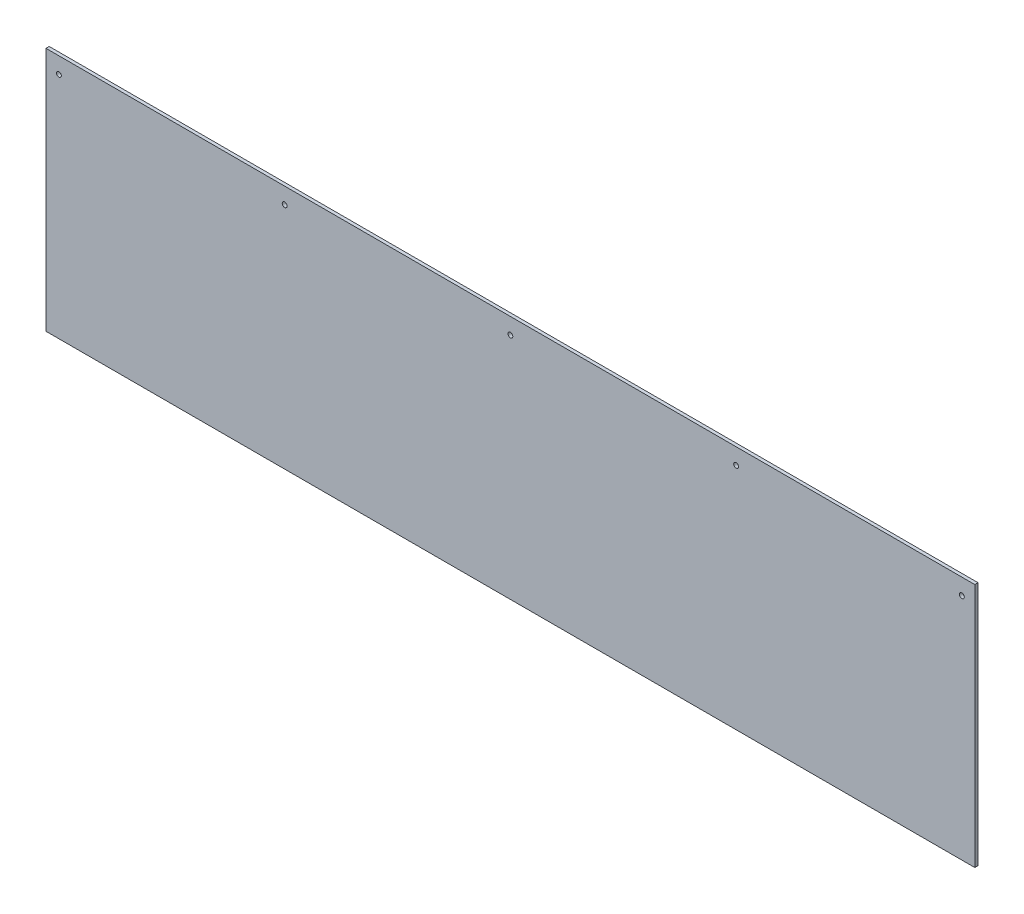
ISO-10303-21;
HEADER;
FILE_DESCRIPTION(('STEP AP214'),'2;1');
FILE_NAME('part.step','',(''),(''),'','','');
FILE_SCHEMA(('AUTOMOTIVE_DESIGN { 1 0 10303 214 1 1 1 1 }'));
ENDSEC;
DATA;
#1=APPLICATION_CONTEXT('core data for automotive mechanical design processes');
#2=APPLICATION_PROTOCOL_DEFINITION('international standard','automotive_design',2000,#1);
#3=PRODUCT_CONTEXT('',#1,'mechanical');
#4=PRODUCT('Part','Part','',(#3));
#5=PRODUCT_RELATED_PRODUCT_CATEGORY('part','',(#4));
#6=PRODUCT_DEFINITION_FORMATION('','',#4);
#7=PRODUCT_DEFINITION_CONTEXT('part definition',#1,'design');
#8=PRODUCT_DEFINITION('design','',#6,#7);
#9=PRODUCT_DEFINITION_SHAPE('','',#8);
#10=(LENGTH_UNIT() NAMED_UNIT(*) SI_UNIT(.MILLI.,.METRE.));
#11=(NAMED_UNIT(*) PLANE_ANGLE_UNIT() SI_UNIT($,.RADIAN.));
#12=(NAMED_UNIT(*) SI_UNIT($,.STERADIAN.) SOLID_ANGLE_UNIT());
#13=UNCERTAINTY_MEASURE_WITH_UNIT(LENGTH_MEASURE(1.E-05),#10,'distance_accuracy_value','');
#14=(GEOMETRIC_REPRESENTATION_CONTEXT(3) GLOBAL_UNCERTAINTY_ASSIGNED_CONTEXT((#13)) GLOBAL_UNIT_ASSIGNED_CONTEXT((#10,
#11,#12)) REPRESENTATION_CONTEXT('',''));
#15=CARTESIAN_POINT('',(0.,0.,0.));
#16=DIRECTION('',(0.,0.,1.));
#17=DIRECTION('',(1.,0.,0.));
#18=AXIS2_PLACEMENT_3D('',#15,#16,#17);
#19=CARTESIAN_POINT('',(0.,0.,6.35));
#20=DIRECTION('',(1.,0.,0.));
#21=DIRECTION('',(0.,0.,-1.));
#22=AXIS2_PLACEMENT_3D('',#19,#20,#21);
#23=PLANE('',#22);
#24=DIRECTION('',(0.,-1.,0.));
#25=VECTOR('',#24,1.);
#26=CARTESIAN_POINT('',(0.,0.,0.));
#27=LINE('',#26,#25);
#28=CARTESIAN_POINT('',(0.,482.6,0.));
#29=VERTEX_POINT('',#28);
#30=CARTESIAN_POINT('',(0.,0.,0.));
#31=VERTEX_POINT('',#30);
#32=EDGE_CURVE('E96',#29,#31,#27,.T.);
#33=ORIENTED_EDGE('',*,*,#32,.T.);
#34=DIRECTION('',(0.,0.,-1.));
#35=VECTOR('',#34,1.);
#36=CARTESIAN_POINT('',(0.,0.,6.35));
#37=LINE('',#36,#35);
#38=CARTESIAN_POINT('',(0.,0.,6.35));
#39=VERTEX_POINT('',#38);
#40=EDGE_CURVE('E11',#39,#31,#37,.T.);
#41=ORIENTED_EDGE('',*,*,#40,.F.);
#42=DIRECTION('',(0.,-1.,0.));
#43=VECTOR('',#42,1.);
#44=CARTESIAN_POINT('',(0.,0.,6.35));
#45=LINE('',#44,#43);
#46=CARTESIAN_POINT('',(0.,482.6,6.35));
#47=VERTEX_POINT('',#46);
#48=EDGE_CURVE('E84',#47,#39,#45,.T.);
#49=ORIENTED_EDGE('',*,*,#48,.F.);
#50=DIRECTION('',(0.,0.,-1.));
#51=VECTOR('',#50,1.);
#52=CARTESIAN_POINT('',(0.,482.6,6.35));
#53=LINE('',#52,#51);
#54=EDGE_CURVE('E92',#47,#29,#53,.T.);
#55=ORIENTED_EDGE('',*,*,#54,.T.);
#56=EDGE_LOOP('',(#33,#41,#49,#55));
#57=FACE_BOUND('',#56,.T.);
#58=ADVANCED_FACE('F33',(#57),#23,.F.);
#59=CARTESIAN_POINT('',(0.,0.,6.35));
#60=DIRECTION('',(0.,1.,0.));
#61=DIRECTION('',(0.,0.,1.));
#62=AXIS2_PLACEMENT_3D('',#59,#60,#61);
#63=PLANE('',#62);
#64=DIRECTION('',(1.,0.,0.));
#65=VECTOR('',#64,1.);
#66=CARTESIAN_POINT('',(0.,0.,0.));
#67=LINE('',#66,#65);
#68=CARTESIAN_POINT('',(1828.8,0.,0.));
#69=VERTEX_POINT('',#68);
#70=EDGE_CURVE('E88',#31,#69,#67,.T.);
#71=ORIENTED_EDGE('',*,*,#70,.T.);
#72=DIRECTION('',(0.,0.,-1.));
#73=VECTOR('',#72,1.);
#74=CARTESIAN_POINT('',(1828.8,0.,6.35));
#75=LINE('',#74,#73);
#76=CARTESIAN_POINT('',(1828.8,0.,6.35));
#77=VERTEX_POINT('',#76);
#78=EDGE_CURVE('E41',#77,#69,#75,.T.);
#79=ORIENTED_EDGE('',*,*,#78,.F.);
#80=DIRECTION('',(1.,0.,0.));
#81=VECTOR('',#80,1.);
#82=CARTESIAN_POINT('',(0.,0.,6.35));
#83=LINE('',#82,#81);
#84=EDGE_CURVE('E79',#39,#77,#83,.T.);
#85=ORIENTED_EDGE('',*,*,#84,.F.);
#86=ORIENTED_EDGE('',*,*,#40,.T.);
#87=EDGE_LOOP('',(#71,#79,#85,#86));
#88=FACE_BOUND('',#87,.T.);
#89=ADVANCED_FACE('F87',(#88),#63,.F.);
#90=CARTESIAN_POINT('',(1828.8,0.,6.35));
#91=DIRECTION('',(-1.,0.,0.));
#92=DIRECTION('',(0.,0.,1.));
#93=AXIS2_PLACEMENT_3D('',#90,#91,#92);
#94=PLANE('',#93);
#95=DIRECTION('',(0.,1.,0.));
#96=VECTOR('',#95,1.);
#97=CARTESIAN_POINT('',(1828.8,0.,0.));
#98=LINE('',#97,#96);
#99=CARTESIAN_POINT('',(1828.8,482.6,0.));
#100=VERTEX_POINT('',#99);
#101=EDGE_CURVE('E66',#69,#100,#98,.T.);
#102=ORIENTED_EDGE('',*,*,#101,.T.);
#103=DIRECTION('',(0.,0.,-1.));
#104=VECTOR('',#103,1.);
#105=CARTESIAN_POINT('',(1828.8,482.6,6.35));
#106=LINE('',#105,#104);
#107=CARTESIAN_POINT('',(1828.8,482.6,6.35));
#108=VERTEX_POINT('',#107);
#109=EDGE_CURVE('E89',#108,#100,#106,.T.);
#110=ORIENTED_EDGE('',*,*,#109,.F.);
#111=DIRECTION('',(0.,1.,0.));
#112=VECTOR('',#111,1.);
#113=CARTESIAN_POINT('',(1828.8,0.,6.35));
#114=LINE('',#113,#112);
#115=EDGE_CURVE('E82',#77,#108,#114,.T.);
#116=ORIENTED_EDGE('',*,*,#115,.F.);
#117=ORIENTED_EDGE('',*,*,#78,.T.);
#118=EDGE_LOOP('',(#102,#110,#116,#117));
#119=FACE_BOUND('',#118,.T.);
#120=ADVANCED_FACE('F90',(#119),#94,.F.);
#121=CARTESIAN_POINT('',(0.,482.6,6.35));
#122=DIRECTION('',(0.,-1.,0.));
#123=DIRECTION('',(1.,0.,0.));
#124=AXIS2_PLACEMENT_3D('',#121,#122,#123);
#125=PLANE('',#124);
#126=DIRECTION('',(-1.,0.,0.));
#127=VECTOR('',#126,1.);
#128=CARTESIAN_POINT('',(0.,482.6,0.));
#129=LINE('',#128,#127);
#130=EDGE_CURVE('E72',#100,#29,#129,.T.);
#131=ORIENTED_EDGE('',*,*,#130,.T.);
#132=ORIENTED_EDGE('',*,*,#54,.F.);
#133=DIRECTION('',(-1.,0.,0.));
#134=VECTOR('',#133,1.);
#135=CARTESIAN_POINT('',(0.,482.6,6.35));
#136=LINE('',#135,#134);
#137=EDGE_CURVE('E49',#108,#47,#136,.T.);
#138=ORIENTED_EDGE('',*,*,#137,.F.);
#139=ORIENTED_EDGE('',*,*,#109,.T.);
#140=EDGE_LOOP('',(#131,#132,#138,#139));
#141=FACE_BOUND('',#140,.T.);
#142=ADVANCED_FACE('F104',(#141),#125,.F.);
#143=CARTESIAN_POINT('',(0.,0.,6.35));
#144=DIRECTION('',(0.,0.,-1.));
#145=DIRECTION('',(-1.,0.,0.));
#146=AXIS2_PLACEMENT_3D('',#143,#144,#145);
#147=PLANE('',#146);
#148=CARTESIAN_POINT('',(25.4,450.85,6.35));
#149=DIRECTION('',(0.,0.,1.));
#150=DIRECTION('',(1.,0.,0.));
#151=AXIS2_PLACEMENT_3D('',#148,#149,#150);
#152=CIRCLE('',#151,4.7625);
#153=CARTESIAN_POINT('',(30.1625,450.85,6.35));
#154=VERTEX_POINT('',#153);
#155=EDGE_CURVE('E134',#154,#154,#152,.T.);
#156=ORIENTED_EDGE('',*,*,#155,.F.);
#157=EDGE_LOOP('',(#156));
#158=FACE_BOUND('',#157,.T.);
#159=CARTESIAN_POINT('',(469.9,450.85,6.35));
#160=DIRECTION('',(0.,0.,1.));
#161=DIRECTION('',(1.,0.,0.));
#162=AXIS2_PLACEMENT_3D('',#159,#160,#161);
#163=CIRCLE('',#162,4.76250000000001);
#164=CARTESIAN_POINT('',(474.6625,450.85,6.35));
#165=VERTEX_POINT('',#164);
#166=EDGE_CURVE('E128',#165,#165,#163,.T.);
#167=ORIENTED_EDGE('',*,*,#166,.F.);
#168=EDGE_LOOP('',(#167));
#169=FACE_BOUND('',#168,.T.);
#170=CARTESIAN_POINT('',(914.4,450.85,6.35));
#171=DIRECTION('',(0.,0.,1.));
#172=DIRECTION('',(1.,0.,0.));
#173=AXIS2_PLACEMENT_3D('',#170,#171,#172);
#174=CIRCLE('',#173,4.76250000000001);
#175=CARTESIAN_POINT('',(919.1625,450.85,6.35));
#176=VERTEX_POINT('',#175);
#177=EDGE_CURVE('E122',#176,#176,#174,.T.);
#178=ORIENTED_EDGE('',*,*,#177,.F.);
#179=EDGE_LOOP('',(#178));
#180=FACE_BOUND('',#179,.T.);
#181=CARTESIAN_POINT('',(1358.9,450.85,6.35));
#182=DIRECTION('',(0.,0.,1.));
#183=DIRECTION('',(1.,0.,0.));
#184=AXIS2_PLACEMENT_3D('',#181,#182,#183);
#185=CIRCLE('',#184,4.7624999999999);
#186=CARTESIAN_POINT('',(1363.6625,450.85,6.35));
#187=VERTEX_POINT('',#186);
#188=EDGE_CURVE('E116',#187,#187,#185,.T.);
#189=ORIENTED_EDGE('',*,*,#188,.F.);
#190=EDGE_LOOP('',(#189));
#191=FACE_BOUND('',#190,.T.);
#192=CARTESIAN_POINT('',(1803.4,450.85,6.35));
#193=DIRECTION('',(0.,0.,1.));
#194=DIRECTION('',(1.,0.,0.));
#195=AXIS2_PLACEMENT_3D('',#192,#193,#194);
#196=CIRCLE('',#195,4.7624999999999);
#197=CARTESIAN_POINT('',(1808.1625,450.85,6.35));
#198=VERTEX_POINT('',#197);
#199=EDGE_CURVE('E110',#198,#198,#196,.T.);
#200=ORIENTED_EDGE('',*,*,#199,.F.);
#201=EDGE_LOOP('',(#200));
#202=FACE_BOUND('',#201,.T.);
#203=ORIENTED_EDGE('',*,*,#48,.T.);
#204=ORIENTED_EDGE('',*,*,#84,.T.);
#205=ORIENTED_EDGE('',*,*,#115,.T.);
#206=ORIENTED_EDGE('',*,*,#137,.T.);
#207=EDGE_LOOP('',(#203,#204,#205,#206));
#208=FACE_BOUND('',#207,.T.);
#209=ADVANCED_FACE('F80',(#158,#169,#180,#191,#202,#208),#147,.F.);
#210=CARTESIAN_POINT('',(0.,0.,0.));
#211=DIRECTION('',(0.,0.,-1.));
#212=DIRECTION('',(-1.,0.,0.));
#213=AXIS2_PLACEMENT_3D('',#210,#211,#212);
#214=PLANE('',#213);
#215=CARTESIAN_POINT('',(25.4,450.85,0.));
#216=DIRECTION('',(0.,0.,1.));
#217=DIRECTION('',(1.,0.,0.));
#218=AXIS2_PLACEMENT_3D('',#215,#216,#217);
#219=CIRCLE('',#218,4.7625);
#220=CARTESIAN_POINT('',(30.1625,450.85,0.));
#221=VERTEX_POINT('',#220);
#222=EDGE_CURVE('E99',#221,#221,#219,.T.);
#223=ORIENTED_EDGE('',*,*,#222,.T.);
#224=EDGE_LOOP('',(#223));
#225=FACE_BOUND('',#224,.T.);
#226=CARTESIAN_POINT('',(469.9,450.85,0.));
#227=DIRECTION('',(0.,0.,1.));
#228=DIRECTION('',(1.,0.,0.));
#229=AXIS2_PLACEMENT_3D('',#226,#227,#228);
#230=CIRCLE('',#229,4.76250000000001);
#231=CARTESIAN_POINT('',(474.6625,450.85,0.));
#232=VERTEX_POINT('',#231);
#233=EDGE_CURVE('E131',#232,#232,#230,.T.);
#234=ORIENTED_EDGE('',*,*,#233,.T.);
#235=EDGE_LOOP('',(#234));
#236=FACE_BOUND('',#235,.T.);
#237=CARTESIAN_POINT('',(914.4,450.85,0.));
#238=DIRECTION('',(0.,0.,1.));
#239=DIRECTION('',(1.,0.,0.));
#240=AXIS2_PLACEMENT_3D('',#237,#238,#239);
#241=CIRCLE('',#240,4.76250000000001);
#242=CARTESIAN_POINT('',(919.1625,450.85,0.));
#243=VERTEX_POINT('',#242);
#244=EDGE_CURVE('E125',#243,#243,#241,.T.);
#245=ORIENTED_EDGE('',*,*,#244,.T.);
#246=EDGE_LOOP('',(#245));
#247=FACE_BOUND('',#246,.T.);
#248=CARTESIAN_POINT('',(1358.9,450.85,0.));
#249=DIRECTION('',(0.,0.,1.));
#250=DIRECTION('',(1.,0.,0.));
#251=AXIS2_PLACEMENT_3D('',#248,#249,#250);
#252=CIRCLE('',#251,4.7624999999999);
#253=CARTESIAN_POINT('',(1363.6625,450.85,0.));
#254=VERTEX_POINT('',#253);
#255=EDGE_CURVE('E119',#254,#254,#252,.T.);
#256=ORIENTED_EDGE('',*,*,#255,.T.);
#257=EDGE_LOOP('',(#256));
#258=FACE_BOUND('',#257,.T.);
#259=CARTESIAN_POINT('',(1803.4,450.85,0.));
#260=DIRECTION('',(0.,0.,1.));
#261=DIRECTION('',(1.,0.,0.));
#262=AXIS2_PLACEMENT_3D('',#259,#260,#261);
#263=CIRCLE('',#262,4.7624999999999);
#264=CARTESIAN_POINT('',(1808.1625,450.85,0.));
#265=VERTEX_POINT('',#264);
#266=EDGE_CURVE('E113',#265,#265,#263,.T.);
#267=ORIENTED_EDGE('',*,*,#266,.T.);
#268=EDGE_LOOP('',(#267));
#269=FACE_BOUND('',#268,.T.);
#270=ORIENTED_EDGE('',*,*,#32,.F.);
#271=ORIENTED_EDGE('',*,*,#130,.F.);
#272=ORIENTED_EDGE('',*,*,#101,.F.);
#273=ORIENTED_EDGE('',*,*,#70,.F.);
#274=EDGE_LOOP('',(#270,#271,#272,#273));
#275=FACE_BOUND('',#274,.T.);
#276=ADVANCED_FACE('F107',(#225,#236,#247,#258,#269,#275),#214,.T.);
#277=CARTESIAN_POINT('',(1803.4,450.85,0.));
#278=DIRECTION('',(0.,0.,1.));
#279=DIRECTION('',(1.,0.,0.));
#280=AXIS2_PLACEMENT_3D('',#277,#278,#279);
#281=CYLINDRICAL_SURFACE('',#280,4.7624999999999);
#282=ORIENTED_EDGE('',*,*,#266,.F.);
#283=EDGE_LOOP('',(#282));
#284=FACE_BOUND('',#283,.T.);
#285=ORIENTED_EDGE('',*,*,#199,.T.);
#286=EDGE_LOOP('',(#285));
#287=FACE_BOUND('',#286,.T.);
#288=ADVANCED_FACE('F160',(#284,#287),#281,.F.);
#289=CARTESIAN_POINT('',(1358.9,450.85,0.));
#290=DIRECTION('',(0.,0.,1.));
#291=DIRECTION('',(1.,0.,0.));
#292=AXIS2_PLACEMENT_3D('',#289,#290,#291);
#293=CYLINDRICAL_SURFACE('',#292,4.7624999999999);
#294=ORIENTED_EDGE('',*,*,#255,.F.);
#295=EDGE_LOOP('',(#294));
#296=FACE_BOUND('',#295,.T.);
#297=ORIENTED_EDGE('',*,*,#188,.T.);
#298=EDGE_LOOP('',(#297));
#299=FACE_BOUND('',#298,.T.);
#300=ADVANCED_FACE('F162',(#296,#299),#293,.F.);
#301=CARTESIAN_POINT('',(914.4,450.85,0.));
#302=DIRECTION('',(0.,0.,1.));
#303=DIRECTION('',(1.,0.,0.));
#304=AXIS2_PLACEMENT_3D('',#301,#302,#303);
#305=CYLINDRICAL_SURFACE('',#304,4.76250000000001);
#306=ORIENTED_EDGE('',*,*,#244,.F.);
#307=EDGE_LOOP('',(#306));
#308=FACE_BOUND('',#307,.T.);
#309=ORIENTED_EDGE('',*,*,#177,.T.);
#310=EDGE_LOOP('',(#309));
#311=FACE_BOUND('',#310,.T.);
#312=ADVANCED_FACE('F169',(#308,#311),#305,.F.);
#313=CARTESIAN_POINT('',(469.9,450.85,0.));
#314=DIRECTION('',(0.,0.,1.));
#315=DIRECTION('',(1.,0.,0.));
#316=AXIS2_PLACEMENT_3D('',#313,#314,#315);
#317=CYLINDRICAL_SURFACE('',#316,4.76250000000001);
#318=ORIENTED_EDGE('',*,*,#233,.F.);
#319=EDGE_LOOP('',(#318));
#320=FACE_BOUND('',#319,.T.);
#321=ORIENTED_EDGE('',*,*,#166,.T.);
#322=EDGE_LOOP('',(#321));
#323=FACE_BOUND('',#322,.T.);
#324=ADVANCED_FACE('F145',(#320,#323),#317,.F.);
#325=CARTESIAN_POINT('',(25.4,450.85,0.));
#326=DIRECTION('',(0.,0.,1.));
#327=DIRECTION('',(1.,0.,0.));
#328=AXIS2_PLACEMENT_3D('',#325,#326,#327);
#329=CYLINDRICAL_SURFACE('',#328,4.7625);
#330=ORIENTED_EDGE('',*,*,#222,.F.);
#331=EDGE_LOOP('',(#330));
#332=FACE_BOUND('',#331,.T.);
#333=ORIENTED_EDGE('',*,*,#155,.T.);
#334=EDGE_LOOP('',(#333));
#335=FACE_BOUND('',#334,.T.);
#336=ADVANCED_FACE('F142',(#332,#335),#329,.F.);
#337=CLOSED_SHELL('',(#58,#89,#120,#142,#209,#276,#288,#300,#312,#324,#336));
#338=MANIFOLD_SOLID_BREP('B2',#337);
#339=ADVANCED_BREP_SHAPE_REPRESENTATION('',(#18,#338),#14);
#340=SHAPE_DEFINITION_REPRESENTATION(#9,#339);
ENDSEC;
END-ISO-10303-21;
